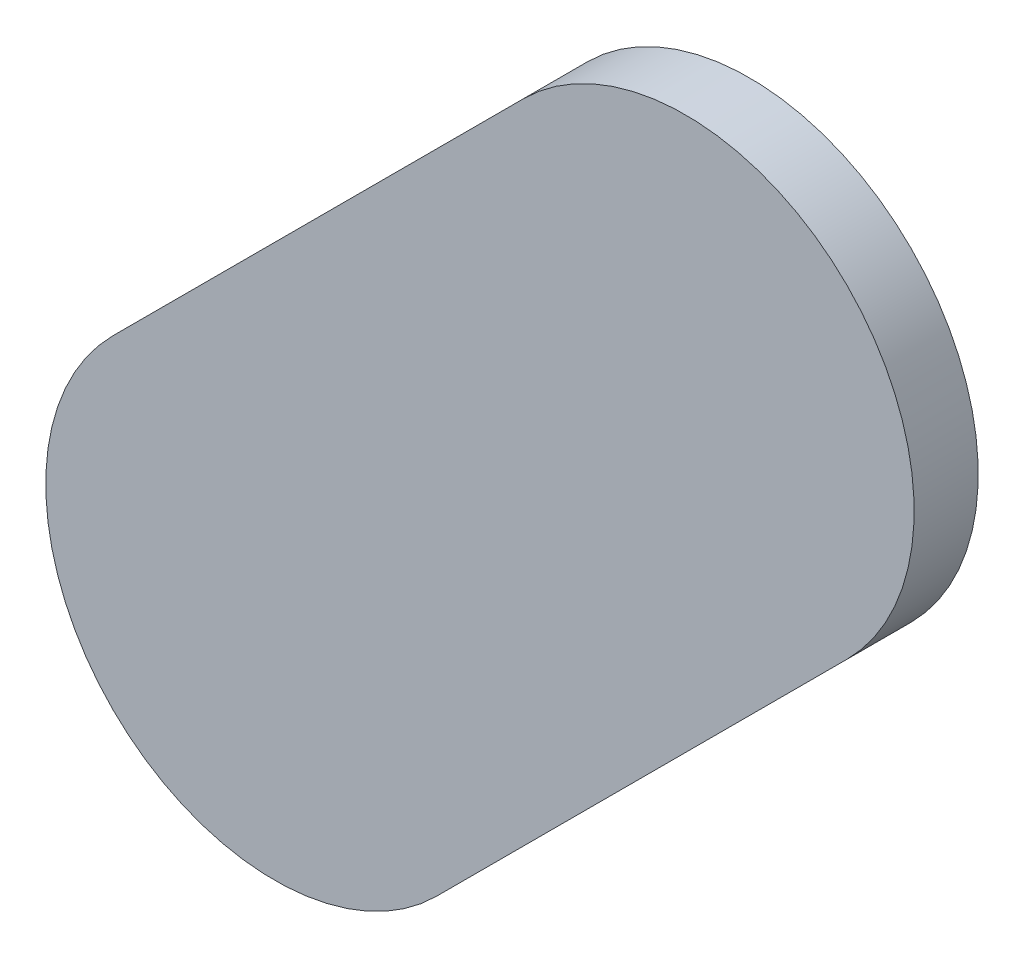
ISO-10303-21;
HEADER;
FILE_DESCRIPTION(('STEP AP214'),'2;1');
FILE_NAME('part.step','',(''),(''),'','','');
FILE_SCHEMA(('AUTOMOTIVE_DESIGN { 1 0 10303 214 1 1 1 1 }'));
ENDSEC;
DATA;
#1=APPLICATION_CONTEXT('core data for automotive mechanical design processes');
#2=APPLICATION_PROTOCOL_DEFINITION('international standard','automotive_design',2000,#1);
#3=PRODUCT_CONTEXT('',#1,'mechanical');
#4=PRODUCT('Part','Part','',(#3));
#5=PRODUCT_RELATED_PRODUCT_CATEGORY('part','',(#4));
#6=PRODUCT_DEFINITION_FORMATION('','',#4);
#7=PRODUCT_DEFINITION_CONTEXT('part definition',#1,'design');
#8=PRODUCT_DEFINITION('design','',#6,#7);
#9=PRODUCT_DEFINITION_SHAPE('','',#8);
#10=(LENGTH_UNIT() NAMED_UNIT(*) SI_UNIT(.MILLI.,.METRE.));
#11=(NAMED_UNIT(*) PLANE_ANGLE_UNIT() SI_UNIT($,.RADIAN.));
#12=(NAMED_UNIT(*) SI_UNIT($,.STERADIAN.) SOLID_ANGLE_UNIT());
#13=UNCERTAINTY_MEASURE_WITH_UNIT(LENGTH_MEASURE(1.E-05),#10,'distance_accuracy_value','');
#14=(GEOMETRIC_REPRESENTATION_CONTEXT(3) GLOBAL_UNCERTAINTY_ASSIGNED_CONTEXT((#13)) GLOBAL_UNIT_ASSIGNED_CONTEXT((#10,
#11,#12)) REPRESENTATION_CONTEXT('',''));
#15=CARTESIAN_POINT('',(0.,0.,0.));
#16=DIRECTION('',(0.,0.,1.));
#17=DIRECTION('',(1.,0.,0.));
#18=AXIS2_PLACEMENT_3D('',#15,#16,#17);
#19=CARTESIAN_POINT('',(89.44555644,91.36220488,0.));
#20=DIRECTION('',(-0.70710678118657,0.707106781186525,0.));
#21=DIRECTION('',(0.707106781186525,0.70710678118657,0.));
#22=AXIS2_PLACEMENT_3D('',#19,#20,#21);
#23=PLANE('',#22);
#24=DIRECTION('',(0.707106781186525,0.70710678118657,0.));
#25=VECTOR('',#24,1.);
#26=CARTESIAN_POINT('',(89.44555644,91.36220488,0.03556));
#27=LINE('',#26,#25);
#28=CARTESIAN_POINT('',(89.44555644,91.36220488,0.03556));
#29=VERTEX_POINT('',#28);
#30=CARTESIAN_POINT('',(89.67352144,91.59016988,0.03556));
#31=VERTEX_POINT('',#30);
#32=EDGE_CURVE('E11',#29,#31,#27,.T.);
#33=ORIENTED_EDGE('',*,*,#32,.F.);
#34=DIRECTION('',(0.,0.,1.));
#35=VECTOR('',#34,1.);
#36=CARTESIAN_POINT('',(89.44555644,91.36220488,0.));
#37=LINE('',#36,#35);
#38=CARTESIAN_POINT('',(89.44555644,91.36220488,0.));
#39=VERTEX_POINT('',#38);
#40=EDGE_CURVE('E24',#39,#29,#37,.T.);
#41=ORIENTED_EDGE('',*,*,#40,.F.);
#42=DIRECTION('',(0.707106781186525,0.70710678118657,0.));
#43=VECTOR('',#42,1.);
#44=CARTESIAN_POINT('',(89.44555644,91.36220488,0.));
#45=LINE('',#44,#43);
#46=CARTESIAN_POINT('',(89.67352144,91.59016988,0.));
#47=VERTEX_POINT('',#46);
#48=EDGE_CURVE('E75',#39,#47,#45,.T.);
#49=ORIENTED_EDGE('',*,*,#48,.T.);
#50=DIRECTION('',(0.,0.,1.));
#51=VECTOR('',#50,1.);
#52=CARTESIAN_POINT('',(89.67352144,91.59016988,0.));
#53=LINE('',#52,#51);
#54=EDGE_CURVE('E37',#47,#31,#53,.T.);
#55=ORIENTED_EDGE('',*,*,#54,.T.);
#56=EDGE_LOOP('',(#33,#41,#49,#55));
#57=FACE_BOUND('',#56,.T.);
#58=ADVANCED_FACE('F17',(#57),#23,.F.);
#59=CARTESIAN_POINT('',(89.58371974,91.67997158,0.));
#60=DIRECTION('',(0.,0.,-1.));
#61=DIRECTION('',(0.707106781186548,-0.707106781186548,0.));
#62=AXIS2_PLACEMENT_3D('',#59,#60,#61);
#63=CYLINDRICAL_SURFACE('',#62,0.126998782064153);
#64=CARTESIAN_POINT('',(89.58371974,91.67997158,0.03556));
#65=DIRECTION('',(0.,0.,1.));
#66=DIRECTION('',(0.707106781186548,-0.707106781186548,0.));
#67=AXIS2_PLACEMENT_3D('',#64,#65,#66);
#68=CIRCLE('',#67,0.126998782064153);
#69=CARTESIAN_POINT('',(89.49391804,91.76977328,0.03556));
#70=VERTEX_POINT('',#69);
#71=EDGE_CURVE('E83',#31,#70,#68,.T.);
#72=ORIENTED_EDGE('',*,*,#71,.F.);
#73=ORIENTED_EDGE('',*,*,#54,.F.);
#74=CARTESIAN_POINT('',(89.58371974,91.67997158,0.));
#75=DIRECTION('',(0.,0.,1.));
#76=DIRECTION('',(0.707106781186548,-0.707106781186548,0.));
#77=AXIS2_PLACEMENT_3D('',#74,#75,#76);
#78=CIRCLE('',#77,0.126998782064153);
#79=CARTESIAN_POINT('',(89.49391804,91.76977328,0.));
#80=VERTEX_POINT('',#79);
#81=EDGE_CURVE('E81',#47,#80,#78,.T.);
#82=ORIENTED_EDGE('',*,*,#81,.T.);
#83=DIRECTION('',(0.,0.,1.));
#84=VECTOR('',#83,1.);
#85=CARTESIAN_POINT('',(89.49391804,91.76977328,0.));
#86=LINE('',#85,#84);
#87=EDGE_CURVE('E67',#80,#70,#86,.T.);
#88=ORIENTED_EDGE('',*,*,#87,.T.);
#89=EDGE_LOOP('',(#72,#73,#82,#88));
#90=FACE_BOUND('',#89,.T.);
#91=ADVANCED_FACE('F89',(#90),#63,.T.);
#92=CARTESIAN_POINT('',(89.49391804,91.76977328,0.));
#93=DIRECTION('',(0.707106781186548,-0.707106781186548,0.));
#94=DIRECTION('',(-0.707106781186548,-0.707106781186548,0.));
#95=AXIS2_PLACEMENT_3D('',#92,#93,#94);
#96=PLANE('',#95);
#97=DIRECTION('',(-0.707106781186548,-0.707106781186548,0.));
#98=VECTOR('',#97,1.);
#99=CARTESIAN_POINT('',(89.49391804,91.76977328,0.03556));
#100=LINE('',#99,#98);
#101=CARTESIAN_POINT('',(89.26595304,91.54180828,0.03556));
#102=VERTEX_POINT('',#101);
#103=EDGE_CURVE('E71',#70,#102,#100,.T.);
#104=ORIENTED_EDGE('',*,*,#103,.F.);
#105=ORIENTED_EDGE('',*,*,#87,.F.);
#106=DIRECTION('',(-0.707106781186548,-0.707106781186548,0.));
#107=VECTOR('',#106,1.);
#108=CARTESIAN_POINT('',(89.49391804,91.76977328,0.));
#109=LINE('',#108,#107);
#110=CARTESIAN_POINT('',(89.26595304,91.54180828,0.));
#111=VERTEX_POINT('',#110);
#112=EDGE_CURVE('E63',#80,#111,#109,.T.);
#113=ORIENTED_EDGE('',*,*,#112,.T.);
#114=DIRECTION('',(0.,0.,1.));
#115=VECTOR('',#114,1.);
#116=CARTESIAN_POINT('',(89.26595304,91.54180828,0.));
#117=LINE('',#116,#115);
#118=EDGE_CURVE('E53',#111,#102,#117,.T.);
#119=ORIENTED_EDGE('',*,*,#118,.T.);
#120=EDGE_LOOP('',(#104,#105,#113,#119));
#121=FACE_BOUND('',#120,.T.);
#122=ADVANCED_FACE('F66',(#121),#96,.F.);
#123=CARTESIAN_POINT('',(89.35575474,91.45200658,0.));
#124=DIRECTION('',(0.,0.,-1.));
#125=DIRECTION('',(-0.707106781186492,0.707106781186604,0.));
#126=AXIS2_PLACEMENT_3D('',#123,#124,#125);
#127=CYLINDRICAL_SURFACE('',#126,0.126998782064157);
#128=CARTESIAN_POINT('',(89.35575474,91.45200658,0.03556));
#129=DIRECTION('',(0.,0.,1.));
#130=DIRECTION('',(-0.707106781186492,0.707106781186604,0.));
#131=AXIS2_PLACEMENT_3D('',#128,#129,#130);
#132=CIRCLE('',#131,0.126998782064157);
#133=EDGE_CURVE('E59',#102,#29,#132,.T.);
#134=ORIENTED_EDGE('',*,*,#133,.F.);
#135=ORIENTED_EDGE('',*,*,#118,.F.);
#136=CARTESIAN_POINT('',(89.35575474,91.45200658,0.));
#137=DIRECTION('',(0.,0.,1.));
#138=DIRECTION('',(-0.707106781186492,0.707106781186604,0.));
#139=AXIS2_PLACEMENT_3D('',#136,#137,#138);
#140=CIRCLE('',#139,0.126998782064157);
#141=EDGE_CURVE('E57',#111,#39,#140,.T.);
#142=ORIENTED_EDGE('',*,*,#141,.T.);
#143=ORIENTED_EDGE('',*,*,#40,.T.);
#144=EDGE_LOOP('',(#134,#135,#142,#143));
#145=FACE_BOUND('',#144,.T.);
#146=ADVANCED_FACE('F55',(#145),#127,.T.);
#147=CARTESIAN_POINT('',(89.44555644,91.36220488,0.));
#148=DIRECTION('',(0.,0.,-1.));
#149=DIRECTION('',(-1.,0.,0.));
#150=AXIS2_PLACEMENT_3D('',#147,#148,#149);
#151=PLANE('',#150);
#152=ORIENTED_EDGE('',*,*,#141,.F.);
#153=ORIENTED_EDGE('',*,*,#112,.F.);
#154=ORIENTED_EDGE('',*,*,#81,.F.);
#155=ORIENTED_EDGE('',*,*,#48,.F.);
#156=EDGE_LOOP('',(#152,#153,#154,#155));
#157=FACE_BOUND('',#156,.T.);
#158=ADVANCED_FACE('F74',(#157),#151,.T.);
#159=CARTESIAN_POINT('',(89.44555644,91.36220488,0.03556));
#160=DIRECTION('',(0.,0.,-1.));
#161=DIRECTION('',(-1.,0.,0.));
#162=AXIS2_PLACEMENT_3D('',#159,#160,#161);
#163=PLANE('',#162);
#164=ORIENTED_EDGE('',*,*,#32,.T.);
#165=ORIENTED_EDGE('',*,*,#71,.T.);
#166=ORIENTED_EDGE('',*,*,#103,.T.);
#167=ORIENTED_EDGE('',*,*,#133,.T.);
#168=EDGE_LOOP('',(#164,#165,#166,#167));
#169=FACE_BOUND('',#168,.T.);
#170=ADVANCED_FACE('F91',(#169),#163,.F.);
#171=CLOSED_SHELL('',(#58,#91,#122,#146,#158,#170));
#172=MANIFOLD_SOLID_BREP('B1',#171);
#173=ADVANCED_BREP_SHAPE_REPRESENTATION('',(#18,#172),#14);
#174=SHAPE_DEFINITION_REPRESENTATION(#9,#173);
ENDSEC;
END-ISO-10303-21;
